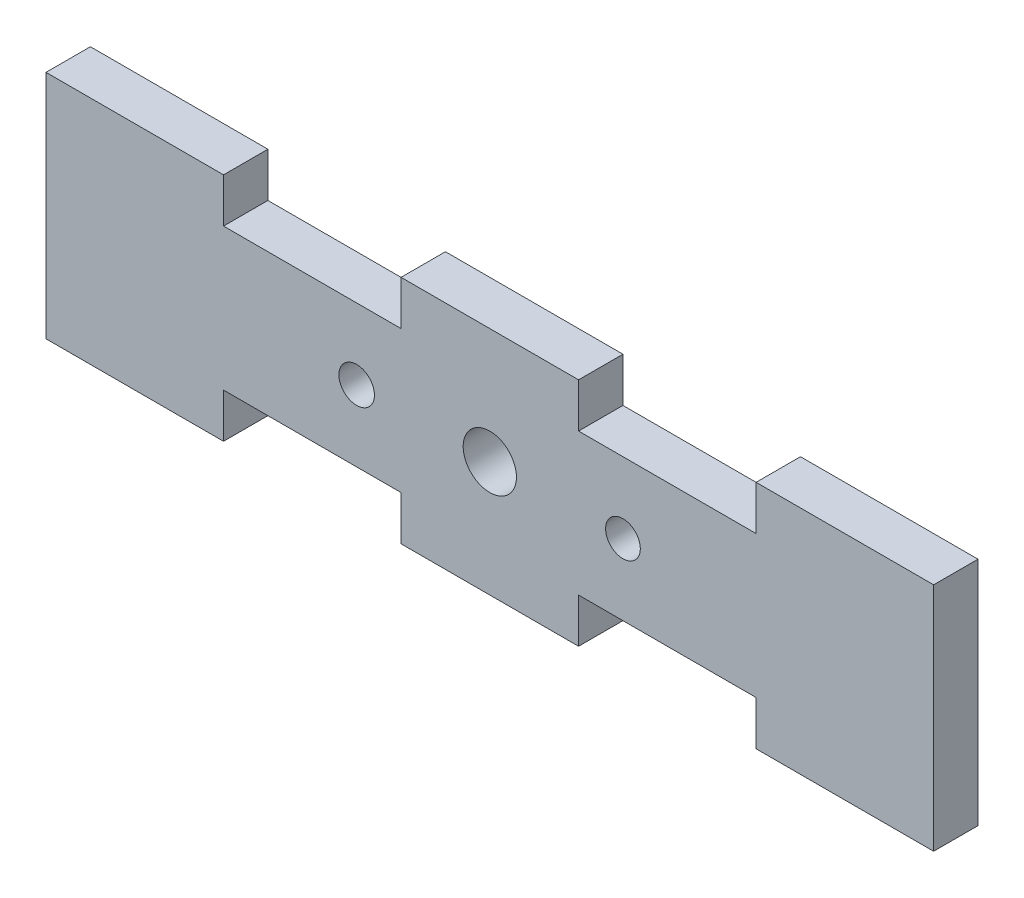
ISO-10303-21;
HEADER;
FILE_DESCRIPTION(('STEP AP214'),'2;1');
FILE_NAME('part.step','',(''),(''),'','','');
FILE_SCHEMA(('AUTOMOTIVE_DESIGN { 1 0 10303 214 1 1 1 1 }'));
ENDSEC;
DATA;
#1=APPLICATION_CONTEXT('core data for automotive mechanical design processes');
#2=APPLICATION_PROTOCOL_DEFINITION('international standard','automotive_design',2000,#1);
#3=PRODUCT_CONTEXT('',#1,'mechanical');
#4=PRODUCT('Part','Part','',(#3));
#5=PRODUCT_RELATED_PRODUCT_CATEGORY('part','',(#4));
#6=PRODUCT_DEFINITION_FORMATION('','',#4);
#7=PRODUCT_DEFINITION_CONTEXT('part definition',#1,'design');
#8=PRODUCT_DEFINITION('design','',#6,#7);
#9=PRODUCT_DEFINITION_SHAPE('','',#8);
#10=(LENGTH_UNIT() NAMED_UNIT(*) SI_UNIT(.MILLI.,.METRE.));
#11=(NAMED_UNIT(*) PLANE_ANGLE_UNIT() SI_UNIT($,.RADIAN.));
#12=(NAMED_UNIT(*) SI_UNIT($,.STERADIAN.) SOLID_ANGLE_UNIT());
#13=UNCERTAINTY_MEASURE_WITH_UNIT(LENGTH_MEASURE(1.E-05),#10,'distance_accuracy_value','');
#14=(GEOMETRIC_REPRESENTATION_CONTEXT(3) GLOBAL_UNCERTAINTY_ASSIGNED_CONTEXT((#13)) GLOBAL_UNIT_ASSIGNED_CONTEXT((#10,
#11,#12)) REPRESENTATION_CONTEXT('',''));
#15=CARTESIAN_POINT('',(0.,0.,0.));
#16=DIRECTION('',(0.,0.,1.));
#17=DIRECTION('',(1.,0.,0.));
#18=AXIS2_PLACEMENT_3D('',#15,#16,#17);
#19=CARTESIAN_POINT('',(0.,0.,2.5));
#20=DIRECTION('',(0.,0.,1.));
#21=DIRECTION('',(1.,0.,0.));
#22=AXIS2_PLACEMENT_3D('',#19,#20,#21);
#23=PLANE('',#22);
#24=CARTESIAN_POINT('',(7.5,0.,2.5));
#25=DIRECTION('',(0.,0.,1.));
#26=DIRECTION('',(1.,0.,0.));
#27=AXIS2_PLACEMENT_3D('',#24,#25,#26);
#28=CIRCLE('',#27,0.977820283434673);
#29=CARTESIAN_POINT('',(8.47782028343467,0.,2.5));
#30=VERTEX_POINT('',#29);
#31=EDGE_CURVE('E390',#30,#30,#28,.T.);
#32=ORIENTED_EDGE('',*,*,#31,.F.);
#33=EDGE_LOOP('',(#32));
#34=FACE_BOUND('',#33,.T.);
#35=DIRECTION('',(-1.,0.,0.));
#36=VECTOR('',#35,1.);
#37=CARTESIAN_POINT('',(15.,6.5,2.5));
#38=LINE('',#37,#36);
#39=CARTESIAN_POINT('',(25.,6.5,2.5));
#40=VERTEX_POINT('',#39);
#41=CARTESIAN_POINT('',(15.,6.5,2.5));
#42=VERTEX_POINT('',#41);
#43=EDGE_CURVE('E240',#40,#42,#38,.T.);
#44=ORIENTED_EDGE('',*,*,#43,.T.);
#45=DIRECTION('',(0.,-1.,0.));
#46=VECTOR('',#45,1.);
#47=CARTESIAN_POINT('',(15.,4.,2.5));
#48=LINE('',#47,#46);
#49=CARTESIAN_POINT('',(15.,4.,2.5));
#50=VERTEX_POINT('',#49);
#51=EDGE_CURVE('E128',#42,#50,#48,.T.);
#52=ORIENTED_EDGE('',*,*,#51,.T.);
#53=DIRECTION('',(-1.,0.,0.));
#54=VECTOR('',#53,1.);
#55=CARTESIAN_POINT('',(4.99999999999999,4.,2.5));
#56=LINE('',#55,#54);
#57=CARTESIAN_POINT('',(4.99999999999999,4.,2.5));
#58=VERTEX_POINT('',#57);
#59=EDGE_CURVE('E291',#50,#58,#56,.T.);
#60=ORIENTED_EDGE('',*,*,#59,.T.);
#61=DIRECTION('',(0.,1.,0.));
#62=VECTOR('',#61,1.);
#63=CARTESIAN_POINT('',(4.99999999999999,6.5,2.5));
#64=LINE('',#63,#62);
#65=CARTESIAN_POINT('',(4.99999999999999,6.5,2.5));
#66=VERTEX_POINT('',#65);
#67=EDGE_CURVE('E310',#58,#66,#64,.T.);
#68=ORIENTED_EDGE('',*,*,#67,.T.);
#69=DIRECTION('',(-1.,0.,0.));
#70=VECTOR('',#69,1.);
#71=CARTESIAN_POINT('',(-5.00000000000001,6.5,2.5));
#72=LINE('',#71,#70);
#73=CARTESIAN_POINT('',(-5.00000000000001,6.5,2.5));
#74=VERTEX_POINT('',#73);
#75=EDGE_CURVE('E307',#66,#74,#72,.T.);
#76=ORIENTED_EDGE('',*,*,#75,.T.);
#77=DIRECTION('',(0.,-1.,0.));
#78=VECTOR('',#77,1.);
#79=CARTESIAN_POINT('',(-5.00000000000001,4.,2.5));
#80=LINE('',#79,#78);
#81=CARTESIAN_POINT('',(-5.00000000000001,4.,2.5));
#82=VERTEX_POINT('',#81);
#83=EDGE_CURVE('E309',#74,#82,#80,.T.);
#84=ORIENTED_EDGE('',*,*,#83,.T.);
#85=DIRECTION('',(-1.,0.,0.));
#86=VECTOR('',#85,1.);
#87=CARTESIAN_POINT('',(-15.,4.,2.5));
#88=LINE('',#87,#86);
#89=CARTESIAN_POINT('',(-15.,4.,2.5));
#90=VERTEX_POINT('',#89);
#91=EDGE_CURVE('E312',#82,#90,#88,.T.);
#92=ORIENTED_EDGE('',*,*,#91,.T.);
#93=DIRECTION('',(0.,1.,0.));
#94=VECTOR('',#93,1.);
#95=CARTESIAN_POINT('',(-15.,6.5,2.5));
#96=LINE('',#95,#94);
#97=CARTESIAN_POINT('',(-15.,6.5,2.5));
#98=VERTEX_POINT('',#97);
#99=EDGE_CURVE('E318',#90,#98,#96,.T.);
#100=ORIENTED_EDGE('',*,*,#99,.T.);
#101=DIRECTION('',(-1.,0.,0.));
#102=VECTOR('',#101,1.);
#103=CARTESIAN_POINT('',(-25.,6.5,2.5));
#104=LINE('',#103,#102);
#105=CARTESIAN_POINT('',(-25.,6.5,2.5));
#106=VERTEX_POINT('',#105);
#107=EDGE_CURVE('E320',#98,#106,#104,.T.);
#108=ORIENTED_EDGE('',*,*,#107,.T.);
#109=DIRECTION('',(0.,-1.,0.));
#110=VECTOR('',#109,1.);
#111=CARTESIAN_POINT('',(-25.,-6.5,2.5));
#112=LINE('',#111,#110);
#113=CARTESIAN_POINT('',(-25.,-6.5,2.5));
#114=VERTEX_POINT('',#113);
#115=EDGE_CURVE('E322',#106,#114,#112,.T.);
#116=ORIENTED_EDGE('',*,*,#115,.T.);
#117=DIRECTION('',(1.,0.,0.));
#118=VECTOR('',#117,1.);
#119=CARTESIAN_POINT('',(-25.,-6.5,2.5));
#120=LINE('',#119,#118);
#121=CARTESIAN_POINT('',(-15.,-6.5,2.5));
#122=VERTEX_POINT('',#121);
#123=EDGE_CURVE('E324',#114,#122,#120,.T.);
#124=ORIENTED_EDGE('',*,*,#123,.T.);
#125=DIRECTION('',(0.,1.,0.));
#126=VECTOR('',#125,1.);
#127=CARTESIAN_POINT('',(-15.,-6.5,2.5));
#128=LINE('',#127,#126);
#129=CARTESIAN_POINT('',(-15.,-4.,2.5));
#130=VERTEX_POINT('',#129);
#131=EDGE_CURVE('E326',#122,#130,#128,.T.);
#132=ORIENTED_EDGE('',*,*,#131,.T.);
#133=DIRECTION('',(1.,0.,0.));
#134=VECTOR('',#133,1.);
#135=CARTESIAN_POINT('',(-15.,-4.,2.5));
#136=LINE('',#135,#134);
#137=CARTESIAN_POINT('',(-5.00000000000001,-4.,2.5));
#138=VERTEX_POINT('',#137);
#139=EDGE_CURVE('E328',#130,#138,#136,.T.);
#140=ORIENTED_EDGE('',*,*,#139,.T.);
#141=DIRECTION('',(0.,-1.,0.));
#142=VECTOR('',#141,1.);
#143=CARTESIAN_POINT('',(-5.00000000000001,-4.,2.5));
#144=LINE('',#143,#142);
#145=CARTESIAN_POINT('',(-5.00000000000001,-6.5,2.5));
#146=VERTEX_POINT('',#145);
#147=EDGE_CURVE('E330',#138,#146,#144,.T.);
#148=ORIENTED_EDGE('',*,*,#147,.T.);
#149=DIRECTION('',(1.,0.,0.));
#150=VECTOR('',#149,1.);
#151=CARTESIAN_POINT('',(-5.00000000000001,-6.5,2.5));
#152=LINE('',#151,#150);
#153=CARTESIAN_POINT('',(4.99999999999999,-6.5,2.5));
#154=VERTEX_POINT('',#153);
#155=EDGE_CURVE('E332',#146,#154,#152,.T.);
#156=ORIENTED_EDGE('',*,*,#155,.T.);
#157=DIRECTION('',(0.,1.,0.));
#158=VECTOR('',#157,1.);
#159=CARTESIAN_POINT('',(4.99999999999999,-6.5,2.5));
#160=LINE('',#159,#158);
#161=CARTESIAN_POINT('',(4.99999999999999,-4.,2.5));
#162=VERTEX_POINT('',#161);
#163=EDGE_CURVE('E334',#154,#162,#160,.T.);
#164=ORIENTED_EDGE('',*,*,#163,.T.);
#165=DIRECTION('',(1.,0.,0.));
#166=VECTOR('',#165,1.);
#167=CARTESIAN_POINT('',(4.99999999999999,-4.,2.5));
#168=LINE('',#167,#166);
#169=CARTESIAN_POINT('',(15.,-4.,2.5));
#170=VERTEX_POINT('',#169);
#171=EDGE_CURVE('E183',#162,#170,#168,.T.);
#172=ORIENTED_EDGE('',*,*,#171,.T.);
#173=DIRECTION('',(0.,-1.,0.));
#174=VECTOR('',#173,1.);
#175=CARTESIAN_POINT('',(15.,-4.,2.5));
#176=LINE('',#175,#174);
#177=CARTESIAN_POINT('',(15.,-6.5,2.5));
#178=VERTEX_POINT('',#177);
#179=EDGE_CURVE('E177',#170,#178,#176,.T.);
#180=ORIENTED_EDGE('',*,*,#179,.T.);
#181=DIRECTION('',(1.,0.,0.));
#182=VECTOR('',#181,1.);
#183=CARTESIAN_POINT('',(15.,-6.5,2.5));
#184=LINE('',#183,#182);
#185=CARTESIAN_POINT('',(25.,-6.5,2.5));
#186=VERTEX_POINT('',#185);
#187=EDGE_CURVE('E181',#178,#186,#184,.T.);
#188=ORIENTED_EDGE('',*,*,#187,.T.);
#189=DIRECTION('',(0.,1.,0.));
#190=VECTOR('',#189,1.);
#191=CARTESIAN_POINT('',(25.,-6.5,2.5));
#192=LINE('',#191,#190);
#193=EDGE_CURVE('E49',#186,#40,#192,.T.);
#194=ORIENTED_EDGE('',*,*,#193,.T.);
#195=EDGE_LOOP('',(#44,#52,#60,#68,#76,#84,#92,#100,#108,#116,#124,#132,#140,#148,#156,#164,
#172,#180,#188,#194));
#196=FACE_BOUND('',#195,.T.);
#197=CARTESIAN_POINT('',(0.,0.,2.5));
#198=DIRECTION('',(0.,0.,1.));
#199=DIRECTION('',(1.,0.,0.));
#200=AXIS2_PLACEMENT_3D('',#197,#198,#199);
#201=CIRCLE('',#200,1.5);
#202=CARTESIAN_POINT('',(1.5,0.,2.5));
#203=VERTEX_POINT('',#202);
#204=EDGE_CURVE('E205',#203,#203,#201,.T.);
#205=ORIENTED_EDGE('',*,*,#204,.F.);
#206=EDGE_LOOP('',(#205));
#207=FACE_BOUND('',#206,.T.);
#208=CARTESIAN_POINT('',(-7.5,0.,2.5));
#209=DIRECTION('',(0.,0.,1.));
#210=DIRECTION('',(1.,0.,0.));
#211=AXIS2_PLACEMENT_3D('',#208,#209,#210);
#212=CIRCLE('',#211,1.);
#213=CARTESIAN_POINT('',(-6.5,0.,2.5));
#214=VERTEX_POINT('',#213);
#215=EDGE_CURVE('E381',#214,#214,#212,.T.);
#216=ORIENTED_EDGE('',*,*,#215,.F.);
#217=EDGE_LOOP('',(#216));
#218=FACE_BOUND('',#217,.T.);
#219=ADVANCED_FACE('F32',(#34,#196,#207,#218),#23,.T.);
#220=CARTESIAN_POINT('',(0.,0.,0.));
#221=DIRECTION('',(0.,0.,1.));
#222=DIRECTION('',(1.,0.,0.));
#223=AXIS2_PLACEMENT_3D('',#220,#221,#222);
#224=PLANE('',#223);
#225=CARTESIAN_POINT('',(7.5,0.,0.));
#226=DIRECTION('',(0.,0.,1.));
#227=DIRECTION('',(1.,0.,0.));
#228=AXIS2_PLACEMENT_3D('',#225,#226,#227);
#229=CIRCLE('',#228,0.977820283434673);
#230=CARTESIAN_POINT('',(8.47782028343467,0.,0.));
#231=VERTEX_POINT('',#230);
#232=EDGE_CURVE('E387',#231,#231,#229,.T.);
#233=ORIENTED_EDGE('',*,*,#232,.T.);
#234=EDGE_LOOP('',(#233));
#235=FACE_BOUND('',#234,.T.);
#236=DIRECTION('',(-1.,0.,0.));
#237=VECTOR('',#236,1.);
#238=CARTESIAN_POINT('',(15.,6.5,0.));
#239=LINE('',#238,#237);
#240=CARTESIAN_POINT('',(25.,6.5,0.));
#241=VERTEX_POINT('',#240);
#242=CARTESIAN_POINT('',(15.,6.5,0.));
#243=VERTEX_POINT('',#242);
#244=EDGE_CURVE('E201',#241,#243,#239,.T.);
#245=ORIENTED_EDGE('',*,*,#244,.F.);
#246=DIRECTION('',(0.,1.,0.));
#247=VECTOR('',#246,1.);
#248=CARTESIAN_POINT('',(25.,-6.5,0.));
#249=LINE('',#248,#247);
#250=CARTESIAN_POINT('',(25.,-6.5,0.));
#251=VERTEX_POINT('',#250);
#252=EDGE_CURVE('E120',#251,#241,#249,.T.);
#253=ORIENTED_EDGE('',*,*,#252,.F.);
#254=DIRECTION('',(1.,0.,0.));
#255=VECTOR('',#254,1.);
#256=CARTESIAN_POINT('',(15.,-6.5,0.));
#257=LINE('',#256,#255);
#258=CARTESIAN_POINT('',(15.,-6.5,0.));
#259=VERTEX_POINT('',#258);
#260=EDGE_CURVE('E114',#259,#251,#257,.T.);
#261=ORIENTED_EDGE('',*,*,#260,.F.);
#262=DIRECTION('',(0.,-1.,0.));
#263=VECTOR('',#262,1.);
#264=CARTESIAN_POINT('',(15.,-4.,0.));
#265=LINE('',#264,#263);
#266=CARTESIAN_POINT('',(15.,-4.,0.));
#267=VERTEX_POINT('',#266);
#268=EDGE_CURVE('E191',#267,#259,#265,.T.);
#269=ORIENTED_EDGE('',*,*,#268,.F.);
#270=DIRECTION('',(1.,0.,0.));
#271=VECTOR('',#270,1.);
#272=CARTESIAN_POINT('',(4.99999999999999,-4.,0.));
#273=LINE('',#272,#271);
#274=CARTESIAN_POINT('',(4.99999999999999,-4.,0.));
#275=VERTEX_POINT('',#274);
#276=EDGE_CURVE('E235',#275,#267,#273,.T.);
#277=ORIENTED_EDGE('',*,*,#276,.F.);
#278=DIRECTION('',(0.,1.,0.));
#279=VECTOR('',#278,1.);
#280=CARTESIAN_POINT('',(4.99999999999999,-6.5,0.));
#281=LINE('',#280,#279);
#282=CARTESIAN_POINT('',(4.99999999999999,-6.5,0.));
#283=VERTEX_POINT('',#282);
#284=EDGE_CURVE('E233',#283,#275,#281,.T.);
#285=ORIENTED_EDGE('',*,*,#284,.F.);
#286=DIRECTION('',(1.,0.,0.));
#287=VECTOR('',#286,1.);
#288=CARTESIAN_POINT('',(-5.00000000000001,-6.5,0.));
#289=LINE('',#288,#287);
#290=CARTESIAN_POINT('',(-5.00000000000001,-6.5,0.));
#291=VERTEX_POINT('',#290);
#292=EDGE_CURVE('E231',#291,#283,#289,.T.);
#293=ORIENTED_EDGE('',*,*,#292,.F.);
#294=DIRECTION('',(0.,-1.,0.));
#295=VECTOR('',#294,1.);
#296=CARTESIAN_POINT('',(-5.00000000000001,-4.,0.));
#297=LINE('',#296,#295);
#298=CARTESIAN_POINT('',(-5.00000000000001,-4.,0.));
#299=VERTEX_POINT('',#298);
#300=EDGE_CURVE('E229',#299,#291,#297,.T.);
#301=ORIENTED_EDGE('',*,*,#300,.F.);
#302=DIRECTION('',(1.,0.,0.));
#303=VECTOR('',#302,1.);
#304=CARTESIAN_POINT('',(-15.,-4.,0.));
#305=LINE('',#304,#303);
#306=CARTESIAN_POINT('',(-15.,-4.,0.));
#307=VERTEX_POINT('',#306);
#308=EDGE_CURVE('E227',#307,#299,#305,.T.);
#309=ORIENTED_EDGE('',*,*,#308,.F.);
#310=DIRECTION('',(0.,1.,0.));
#311=VECTOR('',#310,1.);
#312=CARTESIAN_POINT('',(-15.,-6.5,0.));
#313=LINE('',#312,#311);
#314=CARTESIAN_POINT('',(-15.,-6.5,0.));
#315=VERTEX_POINT('',#314);
#316=EDGE_CURVE('E225',#315,#307,#313,.T.);
#317=ORIENTED_EDGE('',*,*,#316,.F.);
#318=DIRECTION('',(1.,0.,0.));
#319=VECTOR('',#318,1.);
#320=CARTESIAN_POINT('',(-25.,-6.5,0.));
#321=LINE('',#320,#319);
#322=CARTESIAN_POINT('',(-25.,-6.5,0.));
#323=VERTEX_POINT('',#322);
#324=EDGE_CURVE('E223',#323,#315,#321,.T.);
#325=ORIENTED_EDGE('',*,*,#324,.F.);
#326=DIRECTION('',(0.,-1.,0.));
#327=VECTOR('',#326,1.);
#328=CARTESIAN_POINT('',(-25.,-6.5,0.));
#329=LINE('',#328,#327);
#330=CARTESIAN_POINT('',(-25.,6.5,0.));
#331=VERTEX_POINT('',#330);
#332=EDGE_CURVE('E221',#331,#323,#329,.T.);
#333=ORIENTED_EDGE('',*,*,#332,.F.);
#334=DIRECTION('',(-1.,0.,0.));
#335=VECTOR('',#334,1.);
#336=CARTESIAN_POINT('',(-25.,6.5,0.));
#337=LINE('',#336,#335);
#338=CARTESIAN_POINT('',(-15.,6.5,0.));
#339=VERTEX_POINT('',#338);
#340=EDGE_CURVE('E219',#339,#331,#337,.T.);
#341=ORIENTED_EDGE('',*,*,#340,.F.);
#342=DIRECTION('',(0.,1.,0.));
#343=VECTOR('',#342,1.);
#344=CARTESIAN_POINT('',(-15.,6.5,0.));
#345=LINE('',#344,#343);
#346=CARTESIAN_POINT('',(-15.,4.,0.));
#347=VERTEX_POINT('',#346);
#348=EDGE_CURVE('E217',#347,#339,#345,.T.);
#349=ORIENTED_EDGE('',*,*,#348,.F.);
#350=DIRECTION('',(-1.,0.,0.));
#351=VECTOR('',#350,1.);
#352=CARTESIAN_POINT('',(-15.,4.,0.));
#353=LINE('',#352,#351);
#354=CARTESIAN_POINT('',(-5.00000000000001,4.,0.));
#355=VERTEX_POINT('',#354);
#356=EDGE_CURVE('E215',#355,#347,#353,.T.);
#357=ORIENTED_EDGE('',*,*,#356,.F.);
#358=DIRECTION('',(0.,-1.,0.));
#359=VECTOR('',#358,1.);
#360=CARTESIAN_POINT('',(-5.00000000000001,4.,0.));
#361=LINE('',#360,#359);
#362=CARTESIAN_POINT('',(-5.00000000000001,6.5,0.));
#363=VERTEX_POINT('',#362);
#364=EDGE_CURVE('E213',#363,#355,#361,.T.);
#365=ORIENTED_EDGE('',*,*,#364,.F.);
#366=DIRECTION('',(-1.,0.,0.));
#367=VECTOR('',#366,1.);
#368=CARTESIAN_POINT('',(-5.00000000000001,6.5,0.));
#369=LINE('',#368,#367);
#370=CARTESIAN_POINT('',(4.99999999999999,6.5,0.));
#371=VERTEX_POINT('',#370);
#372=EDGE_CURVE('E211',#371,#363,#369,.T.);
#373=ORIENTED_EDGE('',*,*,#372,.F.);
#374=DIRECTION('',(0.,1.,0.));
#375=VECTOR('',#374,1.);
#376=CARTESIAN_POINT('',(4.99999999999999,6.5,0.));
#377=LINE('',#376,#375);
#378=CARTESIAN_POINT('',(4.99999999999999,4.,0.));
#379=VERTEX_POINT('',#378);
#380=EDGE_CURVE('E209',#379,#371,#377,.T.);
#381=ORIENTED_EDGE('',*,*,#380,.F.);
#382=DIRECTION('',(-1.,0.,0.));
#383=VECTOR('',#382,1.);
#384=CARTESIAN_POINT('',(4.99999999999999,4.,0.));
#385=LINE('',#384,#383);
#386=CARTESIAN_POINT('',(15.,4.,0.));
#387=VERTEX_POINT('',#386);
#388=EDGE_CURVE('E207',#387,#379,#385,.T.);
#389=ORIENTED_EDGE('',*,*,#388,.F.);
#390=DIRECTION('',(0.,-1.,0.));
#391=VECTOR('',#390,1.);
#392=CARTESIAN_POINT('',(15.,4.,0.));
#393=LINE('',#392,#391);
#394=EDGE_CURVE('E204',#243,#387,#393,.T.);
#395=ORIENTED_EDGE('',*,*,#394,.F.);
#396=EDGE_LOOP('',(#245,#253,#261,#269,#277,#285,#293,#301,#309,#317,#325,#333,#341,#349,#357,
#365,#373,#381,#389,#395));
#397=FACE_BOUND('',#396,.T.);
#398=CARTESIAN_POINT('',(0.,0.,0.));
#399=DIRECTION('',(0.,0.,1.));
#400=DIRECTION('',(1.,0.,0.));
#401=AXIS2_PLACEMENT_3D('',#398,#399,#400);
#402=CIRCLE('',#401,1.5);
#403=CARTESIAN_POINT('',(1.5,0.,0.));
#404=VERTEX_POINT('',#403);
#405=EDGE_CURVE('E393',#404,#404,#402,.T.);
#406=ORIENTED_EDGE('',*,*,#405,.T.);
#407=EDGE_LOOP('',(#406));
#408=FACE_BOUND('',#407,.T.);
#409=CARTESIAN_POINT('',(-7.5,0.,0.));
#410=DIRECTION('',(0.,0.,1.));
#411=DIRECTION('',(1.,0.,0.));
#412=AXIS2_PLACEMENT_3D('',#409,#410,#411);
#413=CIRCLE('',#412,1.);
#414=CARTESIAN_POINT('',(-6.5,0.,0.));
#415=VERTEX_POINT('',#414);
#416=EDGE_CURVE('E384',#415,#415,#413,.T.);
#417=ORIENTED_EDGE('',*,*,#416,.T.);
#418=EDGE_LOOP('',(#417));
#419=FACE_BOUND('',#418,.T.);
#420=ADVANCED_FACE('F295',(#235,#397,#408,#419),#224,.F.);
#421=CARTESIAN_POINT('',(15.,6.5,2.5));
#422=DIRECTION('',(0.,-1.,0.));
#423=DIRECTION('',(0.,0.,-1.));
#424=AXIS2_PLACEMENT_3D('',#421,#422,#423);
#425=PLANE('',#424);
#426=ORIENTED_EDGE('',*,*,#244,.T.);
#427=DIRECTION('',(0.,0.,-1.));
#428=VECTOR('',#427,1.);
#429=CARTESIAN_POINT('',(15.,6.5,2.5));
#430=LINE('',#429,#428);
#431=EDGE_CURVE('E11',#42,#243,#430,.T.);
#432=ORIENTED_EDGE('',*,*,#431,.F.);
#433=ORIENTED_EDGE('',*,*,#43,.F.);
#434=DIRECTION('',(0.,0.,-1.));
#435=VECTOR('',#434,1.);
#436=CARTESIAN_POINT('',(25.,6.5,2.5));
#437=LINE('',#436,#435);
#438=EDGE_CURVE('E197',#40,#241,#437,.T.);
#439=ORIENTED_EDGE('',*,*,#438,.T.);
#440=EDGE_LOOP('',(#426,#432,#433,#439));
#441=FACE_BOUND('',#440,.T.);
#442=ADVANCED_FACE('F34',(#441),#425,.F.);
#443=CARTESIAN_POINT('',(15.,4.,2.5));
#444=DIRECTION('',(1.,0.,0.));
#445=DIRECTION('',(0.,0.,-1.));
#446=AXIS2_PLACEMENT_3D('',#443,#444,#445);
#447=PLANE('',#446);
#448=ORIENTED_EDGE('',*,*,#394,.T.);
#449=DIRECTION('',(0.,0.,-1.));
#450=VECTOR('',#449,1.);
#451=CARTESIAN_POINT('',(15.,4.,2.5));
#452=LINE('',#451,#450);
#453=EDGE_CURVE('E41',#50,#387,#452,.T.);
#454=ORIENTED_EDGE('',*,*,#453,.F.);
#455=ORIENTED_EDGE('',*,*,#51,.F.);
#456=ORIENTED_EDGE('',*,*,#431,.T.);
#457=EDGE_LOOP('',(#448,#454,#455,#456));
#458=FACE_BOUND('',#457,.T.);
#459=ADVANCED_FACE('F574',(#458),#447,.F.);
#460=CARTESIAN_POINT('',(4.99999999999999,4.,2.5));
#461=DIRECTION('',(0.,-1.,0.));
#462=DIRECTION('',(0.,0.,-1.));
#463=AXIS2_PLACEMENT_3D('',#460,#461,#462);
#464=PLANE('',#463);
#465=ORIENTED_EDGE('',*,*,#388,.T.);
#466=DIRECTION('',(0.,0.,-1.));
#467=VECTOR('',#466,1.);
#468=CARTESIAN_POINT('',(4.99999999999999,4.,2.5));
#469=LINE('',#468,#467);
#470=EDGE_CURVE('E283',#58,#379,#469,.T.);
#471=ORIENTED_EDGE('',*,*,#470,.F.);
#472=ORIENTED_EDGE('',*,*,#59,.F.);
#473=ORIENTED_EDGE('',*,*,#453,.T.);
#474=EDGE_LOOP('',(#465,#471,#472,#473));
#475=FACE_BOUND('',#474,.T.);
#476=ADVANCED_FACE('F289',(#475),#464,.F.);
#477=CARTESIAN_POINT('',(4.99999999999999,6.5,2.5));
#478=DIRECTION('',(-1.,0.,0.));
#479=DIRECTION('',(0.,0.,1.));
#480=AXIS2_PLACEMENT_3D('',#477,#478,#479);
#481=PLANE('',#480);
#482=ORIENTED_EDGE('',*,*,#380,.T.);
#483=DIRECTION('',(0.,0.,-1.));
#484=VECTOR('',#483,1.);
#485=CARTESIAN_POINT('',(4.99999999999999,6.5,2.5));
#486=LINE('',#485,#484);
#487=EDGE_CURVE('E280',#66,#371,#486,.T.);
#488=ORIENTED_EDGE('',*,*,#487,.F.);
#489=ORIENTED_EDGE('',*,*,#67,.F.);
#490=ORIENTED_EDGE('',*,*,#470,.T.);
#491=EDGE_LOOP('',(#482,#488,#489,#490));
#492=FACE_BOUND('',#491,.T.);
#493=ADVANCED_FACE('F301',(#492),#481,.F.);
#494=CARTESIAN_POINT('',(-5.00000000000001,6.5,2.5));
#495=DIRECTION('',(0.,-1.,0.));
#496=DIRECTION('',(0.,0.,-1.));
#497=AXIS2_PLACEMENT_3D('',#494,#495,#496);
#498=PLANE('',#497);
#499=ORIENTED_EDGE('',*,*,#372,.T.);
#500=DIRECTION('',(0.,0.,-1.));
#501=VECTOR('',#500,1.);
#502=CARTESIAN_POINT('',(-5.00000000000001,6.5,2.5));
#503=LINE('',#502,#501);
#504=EDGE_CURVE('E277',#74,#363,#503,.T.);
#505=ORIENTED_EDGE('',*,*,#504,.F.);
#506=ORIENTED_EDGE('',*,*,#75,.F.);
#507=ORIENTED_EDGE('',*,*,#487,.T.);
#508=EDGE_LOOP('',(#499,#505,#506,#507));
#509=FACE_BOUND('',#508,.T.);
#510=ADVANCED_FACE('F305',(#509),#498,.F.);
#511=CARTESIAN_POINT('',(-5.00000000000001,4.,2.5));
#512=DIRECTION('',(1.,0.,0.));
#513=DIRECTION('',(0.,0.,-1.));
#514=AXIS2_PLACEMENT_3D('',#511,#512,#513);
#515=PLANE('',#514);
#516=ORIENTED_EDGE('',*,*,#364,.T.);
#517=DIRECTION('',(0.,0.,-1.));
#518=VECTOR('',#517,1.);
#519=CARTESIAN_POINT('',(-5.00000000000001,4.,2.5));
#520=LINE('',#519,#518);
#521=EDGE_CURVE('E274',#82,#355,#520,.T.);
#522=ORIENTED_EDGE('',*,*,#521,.F.);
#523=ORIENTED_EDGE('',*,*,#83,.F.);
#524=ORIENTED_EDGE('',*,*,#504,.T.);
#525=EDGE_LOOP('',(#516,#522,#523,#524));
#526=FACE_BOUND('',#525,.T.);
#527=ADVANCED_FACE('F539',(#526),#515,.F.);
#528=CARTESIAN_POINT('',(-15.,4.,2.5));
#529=DIRECTION('',(0.,-1.,0.));
#530=DIRECTION('',(0.,0.,-1.));
#531=AXIS2_PLACEMENT_3D('',#528,#529,#530);
#532=PLANE('',#531);
#533=ORIENTED_EDGE('',*,*,#356,.T.);
#534=DIRECTION('',(0.,0.,-1.));
#535=VECTOR('',#534,1.);
#536=CARTESIAN_POINT('',(-15.,4.,2.5));
#537=LINE('',#536,#535);
#538=EDGE_CURVE('E271',#90,#347,#537,.T.);
#539=ORIENTED_EDGE('',*,*,#538,.F.);
#540=ORIENTED_EDGE('',*,*,#91,.F.);
#541=ORIENTED_EDGE('',*,*,#521,.T.);
#542=EDGE_LOOP('',(#533,#539,#540,#541));
#543=FACE_BOUND('',#542,.T.);
#544=ADVANCED_FACE('F529',(#543),#532,.F.);
#545=CARTESIAN_POINT('',(-15.,6.5,2.5));
#546=DIRECTION('',(-1.,0.,0.));
#547=DIRECTION('',(0.,-1.,0.));
#548=AXIS2_PLACEMENT_3D('',#545,#546,#547);
#549=PLANE('',#548);
#550=ORIENTED_EDGE('',*,*,#348,.T.);
#551=DIRECTION('',(0.,0.,-1.));
#552=VECTOR('',#551,1.);
#553=CARTESIAN_POINT('',(-15.,6.5,2.5));
#554=LINE('',#553,#552);
#555=EDGE_CURVE('E268',#98,#339,#554,.T.);
#556=ORIENTED_EDGE('',*,*,#555,.F.);
#557=ORIENTED_EDGE('',*,*,#99,.F.);
#558=ORIENTED_EDGE('',*,*,#538,.T.);
#559=EDGE_LOOP('',(#550,#556,#557,#558));
#560=FACE_BOUND('',#559,.T.);
#561=ADVANCED_FACE('F519',(#560),#549,.F.);
#562=CARTESIAN_POINT('',(-25.,6.5,2.5));
#563=DIRECTION('',(0.,-1.,0.));
#564=DIRECTION('',(0.,0.,-1.));
#565=AXIS2_PLACEMENT_3D('',#562,#563,#564);
#566=PLANE('',#565);
#567=ORIENTED_EDGE('',*,*,#340,.T.);
#568=DIRECTION('',(0.,0.,-1.));
#569=VECTOR('',#568,1.);
#570=CARTESIAN_POINT('',(-25.,6.5,2.5));
#571=LINE('',#570,#569);
#572=EDGE_CURVE('E265',#106,#331,#571,.T.);
#573=ORIENTED_EDGE('',*,*,#572,.F.);
#574=ORIENTED_EDGE('',*,*,#107,.F.);
#575=ORIENTED_EDGE('',*,*,#555,.T.);
#576=EDGE_LOOP('',(#567,#573,#574,#575));
#577=FACE_BOUND('',#576,.T.);
#578=ADVANCED_FACE('F509',(#577),#566,.F.);
#579=CARTESIAN_POINT('',(-25.,-6.5,2.5));
#580=DIRECTION('',(1.,0.,0.));
#581=DIRECTION('',(0.,0.,-1.));
#582=AXIS2_PLACEMENT_3D('',#579,#580,#581);
#583=PLANE('',#582);
#584=ORIENTED_EDGE('',*,*,#332,.T.);
#585=DIRECTION('',(0.,0.,-1.));
#586=VECTOR('',#585,1.);
#587=CARTESIAN_POINT('',(-25.,-6.5,2.5));
#588=LINE('',#587,#586);
#589=EDGE_CURVE('E262',#114,#323,#588,.T.);
#590=ORIENTED_EDGE('',*,*,#589,.F.);
#591=ORIENTED_EDGE('',*,*,#115,.F.);
#592=ORIENTED_EDGE('',*,*,#572,.T.);
#593=EDGE_LOOP('',(#584,#590,#591,#592));
#594=FACE_BOUND('',#593,.T.);
#595=ADVANCED_FACE('F499',(#594),#583,.F.);
#596=CARTESIAN_POINT('',(-25.,-6.5,2.5));
#597=DIRECTION('',(0.,1.,0.));
#598=DIRECTION('',(0.,0.,1.));
#599=AXIS2_PLACEMENT_3D('',#596,#597,#598);
#600=PLANE('',#599);
#601=ORIENTED_EDGE('',*,*,#324,.T.);
#602=DIRECTION('',(0.,0.,-1.));
#603=VECTOR('',#602,1.);
#604=CARTESIAN_POINT('',(-15.,-6.5,2.5));
#605=LINE('',#604,#603);
#606=EDGE_CURVE('E259',#122,#315,#605,.T.);
#607=ORIENTED_EDGE('',*,*,#606,.F.);
#608=ORIENTED_EDGE('',*,*,#123,.F.);
#609=ORIENTED_EDGE('',*,*,#589,.T.);
#610=EDGE_LOOP('',(#601,#607,#608,#609));
#611=FACE_BOUND('',#610,.T.);
#612=ADVANCED_FACE('F489',(#611),#600,.F.);
#613=CARTESIAN_POINT('',(-15.,-6.5,2.5));
#614=DIRECTION('',(-1.,0.,0.));
#615=DIRECTION('',(0.,0.,1.));
#616=AXIS2_PLACEMENT_3D('',#613,#614,#615);
#617=PLANE('',#616);
#618=ORIENTED_EDGE('',*,*,#316,.T.);
#619=DIRECTION('',(0.,0.,-1.));
#620=VECTOR('',#619,1.);
#621=CARTESIAN_POINT('',(-15.,-4.,2.5));
#622=LINE('',#621,#620);
#623=EDGE_CURVE('E256',#130,#307,#622,.T.);
#624=ORIENTED_EDGE('',*,*,#623,.F.);
#625=ORIENTED_EDGE('',*,*,#131,.F.);
#626=ORIENTED_EDGE('',*,*,#606,.T.);
#627=EDGE_LOOP('',(#618,#624,#625,#626));
#628=FACE_BOUND('',#627,.T.);
#629=ADVANCED_FACE('F479',(#628),#617,.F.);
#630=CARTESIAN_POINT('',(-15.,-4.,2.5));
#631=DIRECTION('',(0.,1.,0.));
#632=DIRECTION('',(0.,0.,1.));
#633=AXIS2_PLACEMENT_3D('',#630,#631,#632);
#634=PLANE('',#633);
#635=ORIENTED_EDGE('',*,*,#308,.T.);
#636=DIRECTION('',(0.,0.,-1.));
#637=VECTOR('',#636,1.);
#638=CARTESIAN_POINT('',(-5.00000000000001,-4.,2.5));
#639=LINE('',#638,#637);
#640=EDGE_CURVE('E253',#138,#299,#639,.T.);
#641=ORIENTED_EDGE('',*,*,#640,.F.);
#642=ORIENTED_EDGE('',*,*,#139,.F.);
#643=ORIENTED_EDGE('',*,*,#623,.T.);
#644=EDGE_LOOP('',(#635,#641,#642,#643));
#645=FACE_BOUND('',#644,.T.);
#646=ADVANCED_FACE('F469',(#645),#634,.F.);
#647=CARTESIAN_POINT('',(-5.00000000000001,-4.,2.5));
#648=DIRECTION('',(1.,0.,0.));
#649=DIRECTION('',(0.,0.,-1.));
#650=AXIS2_PLACEMENT_3D('',#647,#648,#649);
#651=PLANE('',#650);
#652=ORIENTED_EDGE('',*,*,#300,.T.);
#653=DIRECTION('',(0.,0.,-1.));
#654=VECTOR('',#653,1.);
#655=CARTESIAN_POINT('',(-5.00000000000001,-6.5,2.5));
#656=LINE('',#655,#654);
#657=EDGE_CURVE('E250',#146,#291,#656,.T.);
#658=ORIENTED_EDGE('',*,*,#657,.F.);
#659=ORIENTED_EDGE('',*,*,#147,.F.);
#660=ORIENTED_EDGE('',*,*,#640,.T.);
#661=EDGE_LOOP('',(#652,#658,#659,#660));
#662=FACE_BOUND('',#661,.T.);
#663=ADVANCED_FACE('F459',(#662),#651,.F.);
#664=CARTESIAN_POINT('',(-5.00000000000001,-6.5,2.5));
#665=DIRECTION('',(0.,1.,0.));
#666=DIRECTION('',(0.,0.,1.));
#667=AXIS2_PLACEMENT_3D('',#664,#665,#666);
#668=PLANE('',#667);
#669=ORIENTED_EDGE('',*,*,#292,.T.);
#670=DIRECTION('',(0.,0.,-1.));
#671=VECTOR('',#670,1.);
#672=CARTESIAN_POINT('',(4.99999999999999,-6.5,2.5));
#673=LINE('',#672,#671);
#674=EDGE_CURVE('E247',#154,#283,#673,.T.);
#675=ORIENTED_EDGE('',*,*,#674,.F.);
#676=ORIENTED_EDGE('',*,*,#155,.F.);
#677=ORIENTED_EDGE('',*,*,#657,.T.);
#678=EDGE_LOOP('',(#669,#675,#676,#677));
#679=FACE_BOUND('',#678,.T.);
#680=ADVANCED_FACE('F450',(#679),#668,.F.);
#681=CARTESIAN_POINT('',(4.99999999999999,-6.5,2.5));
#682=DIRECTION('',(-1.,0.,0.));
#683=DIRECTION('',(0.,0.,1.));
#684=AXIS2_PLACEMENT_3D('',#681,#682,#683);
#685=PLANE('',#684);
#686=ORIENTED_EDGE('',*,*,#284,.T.);
#687=DIRECTION('',(0.,0.,-1.));
#688=VECTOR('',#687,1.);
#689=CARTESIAN_POINT('',(4.99999999999999,-4.,2.5));
#690=LINE('',#689,#688);
#691=EDGE_CURVE('E244',#162,#275,#690,.T.);
#692=ORIENTED_EDGE('',*,*,#691,.F.);
#693=ORIENTED_EDGE('',*,*,#163,.F.);
#694=ORIENTED_EDGE('',*,*,#674,.T.);
#695=EDGE_LOOP('',(#686,#692,#693,#694));
#696=FACE_BOUND('',#695,.T.);
#697=ADVANCED_FACE('F340',(#696),#685,.F.);
#698=CARTESIAN_POINT('',(4.99999999999999,-4.,2.5));
#699=DIRECTION('',(0.,1.,0.));
#700=DIRECTION('',(0.,0.,1.));
#701=AXIS2_PLACEMENT_3D('',#698,#699,#700);
#702=PLANE('',#701);
#703=ORIENTED_EDGE('',*,*,#276,.T.);
#704=DIRECTION('',(0.,0.,-1.));
#705=VECTOR('',#704,1.);
#706=CARTESIAN_POINT('',(15.,-4.,2.5));
#707=LINE('',#706,#705);
#708=EDGE_CURVE('E192',#170,#267,#707,.T.);
#709=ORIENTED_EDGE('',*,*,#708,.F.);
#710=ORIENTED_EDGE('',*,*,#171,.F.);
#711=ORIENTED_EDGE('',*,*,#691,.T.);
#712=EDGE_LOOP('',(#703,#709,#710,#711));
#713=FACE_BOUND('',#712,.T.);
#714=ADVANCED_FACE('F344',(#713),#702,.F.);
#715=CARTESIAN_POINT('',(15.,-4.,2.5));
#716=DIRECTION('',(1.,0.,0.));
#717=DIRECTION('',(0.,0.,-1.));
#718=AXIS2_PLACEMENT_3D('',#715,#716,#717);
#719=PLANE('',#718);
#720=ORIENTED_EDGE('',*,*,#268,.T.);
#721=DIRECTION('',(0.,0.,-1.));
#722=VECTOR('',#721,1.);
#723=CARTESIAN_POINT('',(15.,-6.5,2.5));
#724=LINE('',#723,#722);
#725=EDGE_CURVE('E188',#178,#259,#724,.T.);
#726=ORIENTED_EDGE('',*,*,#725,.F.);
#727=ORIENTED_EDGE('',*,*,#179,.F.);
#728=ORIENTED_EDGE('',*,*,#708,.T.);
#729=EDGE_LOOP('',(#720,#726,#727,#728));
#730=FACE_BOUND('',#729,.T.);
#731=ADVANCED_FACE('F189',(#730),#719,.F.);
#732=CARTESIAN_POINT('',(15.,-6.5,2.5));
#733=DIRECTION('',(0.,1.,0.));
#734=DIRECTION('',(0.,0.,1.));
#735=AXIS2_PLACEMENT_3D('',#732,#733,#734);
#736=PLANE('',#735);
#737=ORIENTED_EDGE('',*,*,#260,.T.);
#738=DIRECTION('',(0.,0.,-1.));
#739=VECTOR('',#738,1.);
#740=CARTESIAN_POINT('',(25.,-6.5,2.5));
#741=LINE('',#740,#739);
#742=EDGE_CURVE('E193',#186,#251,#741,.T.);
#743=ORIENTED_EDGE('',*,*,#742,.F.);
#744=ORIENTED_EDGE('',*,*,#187,.F.);
#745=ORIENTED_EDGE('',*,*,#725,.T.);
#746=EDGE_LOOP('',(#737,#743,#744,#745));
#747=FACE_BOUND('',#746,.T.);
#748=ADVANCED_FACE('F195',(#747),#736,.F.);
#749=CARTESIAN_POINT('',(25.,-6.5,2.5));
#750=DIRECTION('',(-1.,0.,0.));
#751=DIRECTION('',(0.,0.,1.));
#752=AXIS2_PLACEMENT_3D('',#749,#750,#751);
#753=PLANE('',#752);
#754=ORIENTED_EDGE('',*,*,#252,.T.);
#755=ORIENTED_EDGE('',*,*,#438,.F.);
#756=ORIENTED_EDGE('',*,*,#193,.F.);
#757=ORIENTED_EDGE('',*,*,#742,.T.);
#758=EDGE_LOOP('',(#754,#755,#756,#757));
#759=FACE_BOUND('',#758,.T.);
#760=ADVANCED_FACE('F348',(#759),#753,.F.);
#761=CARTESIAN_POINT('',(0.,0.,2.5));
#762=DIRECTION('',(0.,0.,-1.));
#763=DIRECTION('',(-1.,0.,0.));
#764=AXIS2_PLACEMENT_3D('',#761,#762,#763);
#765=CYLINDRICAL_SURFACE('',#764,1.5);
#766=ORIENTED_EDGE('',*,*,#204,.T.);
#767=EDGE_LOOP('',(#766));
#768=FACE_BOUND('',#767,.T.);
#769=ORIENTED_EDGE('',*,*,#405,.F.);
#770=EDGE_LOOP('',(#769));
#771=FACE_BOUND('',#770,.T.);
#772=ADVANCED_FACE('F350',(#768,#771),#765,.F.);
#773=CARTESIAN_POINT('',(7.5,0.,2.5));
#774=DIRECTION('',(0.,0.,-1.));
#775=DIRECTION('',(-1.,0.,0.));
#776=AXIS2_PLACEMENT_3D('',#773,#774,#775);
#777=CYLINDRICAL_SURFACE('',#776,0.977820283434673);
#778=ORIENTED_EDGE('',*,*,#31,.T.);
#779=EDGE_LOOP('',(#778));
#780=FACE_BOUND('',#779,.T.);
#781=ORIENTED_EDGE('',*,*,#232,.F.);
#782=EDGE_LOOP('',(#781));
#783=FACE_BOUND('',#782,.T.);
#784=ADVANCED_FACE('F356',(#780,#783),#777,.F.);
#785=CARTESIAN_POINT('',(-7.5,0.,2.5));
#786=DIRECTION('',(0.,0.,-1.));
#787=DIRECTION('',(-1.,0.,0.));
#788=AXIS2_PLACEMENT_3D('',#785,#786,#787);
#789=CYLINDRICAL_SURFACE('',#788,1.);
#790=ORIENTED_EDGE('',*,*,#215,.T.);
#791=EDGE_LOOP('',(#790));
#792=FACE_BOUND('',#791,.T.);
#793=ORIENTED_EDGE('',*,*,#416,.F.);
#794=EDGE_LOOP('',(#793));
#795=FACE_BOUND('',#794,.T.);
#796=ADVANCED_FACE('F372',(#792,#795),#789,.F.);
#797=CLOSED_SHELL('',(#219,#420,#442,#459,#476,#493,#510,#527,#544,#561,#578,#595,#612,#629,
#646,#663,#680,#697,#714,#731,#748,#760,#772,#784,#796));
#798=MANIFOLD_SOLID_BREP('B2',#797);
#799=ADVANCED_BREP_SHAPE_REPRESENTATION('',(#18,#798),#14);
#800=SHAPE_DEFINITION_REPRESENTATION(#9,#799);
ENDSEC;
END-ISO-10303-21;
